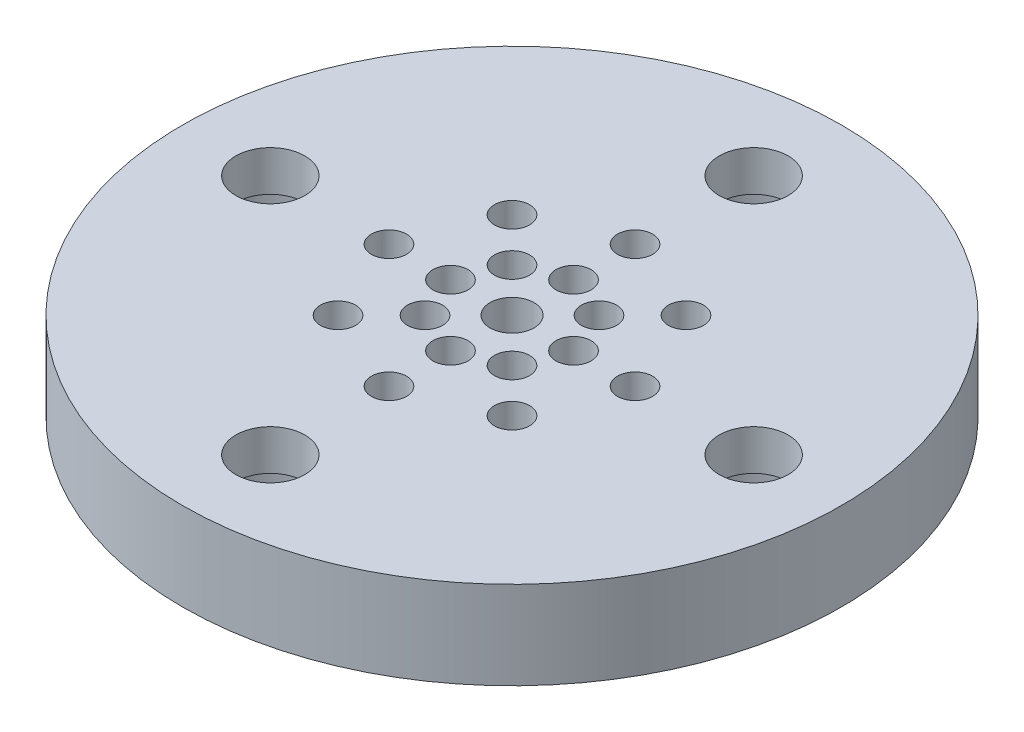
ISO-10303-21;
HEADER;
FILE_DESCRIPTION(('STEP AP214'),'2;1');
FILE_NAME('part.step','',(''),(''),'','','');
FILE_SCHEMA(('AUTOMOTIVE_DESIGN { 1 0 10303 214 1 1 1 1 }'));
ENDSEC;
DATA;
#1=APPLICATION_CONTEXT('core data for automotive mechanical design processes');
#2=APPLICATION_PROTOCOL_DEFINITION('international standard','automotive_design',2000,#1);
#3=PRODUCT_CONTEXT('',#1,'mechanical');
#4=PRODUCT('Part','Part','',(#3));
#5=PRODUCT_RELATED_PRODUCT_CATEGORY('part','',(#4));
#6=PRODUCT_DEFINITION_FORMATION('','',#4);
#7=PRODUCT_DEFINITION_CONTEXT('part definition',#1,'design');
#8=PRODUCT_DEFINITION('design','',#6,#7);
#9=PRODUCT_DEFINITION_SHAPE('','',#8);
#10=(LENGTH_UNIT() NAMED_UNIT(*) SI_UNIT(.MILLI.,.METRE.));
#11=(NAMED_UNIT(*) PLANE_ANGLE_UNIT() SI_UNIT($,.RADIAN.));
#12=(NAMED_UNIT(*) SI_UNIT($,.STERADIAN.) SOLID_ANGLE_UNIT());
#13=UNCERTAINTY_MEASURE_WITH_UNIT(LENGTH_MEASURE(1.E-05),#10,'distance_accuracy_value','');
#14=(GEOMETRIC_REPRESENTATION_CONTEXT(3) GLOBAL_UNCERTAINTY_ASSIGNED_CONTEXT((#13)) GLOBAL_UNIT_ASSIGNED_CONTEXT((#10,
#11,#12)) REPRESENTATION_CONTEXT('',''));
#15=CARTESIAN_POINT('',(0.,0.,0.));
#16=DIRECTION('',(0.,0.,1.));
#17=DIRECTION('',(1.,0.,0.));
#18=AXIS2_PLACEMENT_3D('',#15,#16,#17);
#19=CARTESIAN_POINT('',(0.,30.48,0.));
#20=DIRECTION('',(0.,-1.,0.));
#21=DIRECTION('',(0.,0.,-1.));
#22=AXIS2_PLACEMENT_3D('',#19,#20,#21);
#23=CYLINDRICAL_SURFACE('',#22,23.8125);
#24=CARTESIAN_POINT('',(0.,0.,0.));
#25=DIRECTION('',(0.,-1.,0.));
#26=DIRECTION('',(0.,0.,-1.));
#27=AXIS2_PLACEMENT_3D('',#24,#25,#26);
#28=CIRCLE('',#27,23.8125);
#29=CARTESIAN_POINT('',(0.,0.,-23.8125));
#30=VERTEX_POINT('',#29);
#31=EDGE_CURVE('E47',#30,#30,#28,.T.);
#32=ORIENTED_EDGE('',*,*,#31,.F.);
#33=EDGE_LOOP('',(#32));
#34=FACE_BOUND('',#33,.T.);
#35=CARTESIAN_POINT('',(0.,6.35,0.));
#36=DIRECTION('',(0.,1.,0.));
#37=DIRECTION('',(0.,0.,1.));
#38=AXIS2_PLACEMENT_3D('',#35,#36,#37);
#39=CIRCLE('',#38,23.8125);
#40=CARTESIAN_POINT('',(0.,6.35,23.8125));
#41=VERTEX_POINT('',#40);
#42=EDGE_CURVE('E97',#41,#41,#39,.T.);
#43=ORIENTED_EDGE('',*,*,#42,.F.);
#44=EDGE_LOOP('',(#43));
#45=FACE_BOUND('',#44,.T.);
#46=ADVANCED_FACE('F34',(#34,#45),#23,.T.);
#47=CARTESIAN_POINT('',(0.,0.,0.));
#48=DIRECTION('',(0.,1.,0.));
#49=DIRECTION('',(0.,0.,1.));
#50=AXIS2_PLACEMENT_3D('',#47,#48,#49);
#51=PLANE('',#50);
#52=CARTESIAN_POINT('',(-8.89,0.,0.));
#53=DIRECTION('',(0.,1.,0.));
#54=DIRECTION('',(-1.,0.,0.));
#55=AXIS2_PLACEMENT_3D('',#52,#53,#54);
#56=CIRCLE('',#55,1.27);
#57=CARTESIAN_POINT('',(-10.16,0.,0.));
#58=VERTEX_POINT('',#57);
#59=EDGE_CURVE('E268',#58,#58,#56,.T.);
#60=ORIENTED_EDGE('',*,*,#59,.T.);
#61=EDGE_LOOP('',(#60));
#62=FACE_BOUND('',#61,.T.);
#63=CARTESIAN_POINT('',(-6.28617928474837,0.,-6.28617928474844));
#64=DIRECTION('',(0.,1.,0.));
#65=DIRECTION('',(-0.707106781186544,0.,-0.707106781186551));
#66=AXIS2_PLACEMENT_3D('',#63,#64,#65);
#67=CIRCLE('',#66,1.27);
#68=CARTESIAN_POINT('',(-7.18420489685528,0.,-7.18420489685536));
#69=VERTEX_POINT('',#68);
#70=EDGE_CURVE('E275',#69,#69,#67,.T.);
#71=ORIENTED_EDGE('',*,*,#70,.T.);
#72=EDGE_LOOP('',(#71));
#73=FACE_BOUND('',#72,.T.);
#74=CARTESIAN_POINT('',(0.,0.,-8.89));
#75=DIRECTION('',(0.,1.,0.));
#76=DIRECTION('',(0.,0.,-1.));
#77=AXIS2_PLACEMENT_3D('',#74,#75,#76);
#78=CIRCLE('',#77,1.27);
#79=CARTESIAN_POINT('',(0.,0.,-10.16));
#80=VERTEX_POINT('',#79);
#81=EDGE_CURVE('E281',#80,#80,#78,.T.);
#82=ORIENTED_EDGE('',*,*,#81,.T.);
#83=EDGE_LOOP('',(#82));
#84=FACE_BOUND('',#83,.T.);
#85=CARTESIAN_POINT('',(6.28617928474846,0.,-6.28617928474835));
#86=DIRECTION('',(0.,1.,0.));
#87=DIRECTION('',(0.707106781186554,0.,-0.707106781186541));
#88=AXIS2_PLACEMENT_3D('',#85,#86,#87);
#89=CIRCLE('',#88,1.27);
#90=CARTESIAN_POINT('',(7.18420489685538,0.,-7.18420489685526));
#91=VERTEX_POINT('',#90);
#92=EDGE_CURVE('E287',#91,#91,#89,.T.);
#93=ORIENTED_EDGE('',*,*,#92,.T.);
#94=EDGE_LOOP('',(#93));
#95=FACE_BOUND('',#94,.T.);
#96=CARTESIAN_POINT('',(8.89,0.,0.));
#97=DIRECTION('',(0.,1.,0.));
#98=DIRECTION('',(1.,0.,0.));
#99=AXIS2_PLACEMENT_3D('',#96,#97,#98);
#100=CIRCLE('',#99,1.27);
#101=CARTESIAN_POINT('',(10.16,0.,1.06420351207939E-13));
#102=VERTEX_POINT('',#101);
#103=EDGE_CURVE('E253',#102,#102,#100,.T.);
#104=ORIENTED_EDGE('',*,*,#103,.T.);
#105=EDGE_LOOP('',(#104));
#106=FACE_BOUND('',#105,.T.);
#107=CARTESIAN_POINT('',(6.28617928474833,0.,6.28617928474848));
#108=DIRECTION('',(0.,1.,0.));
#109=DIRECTION('',(0.707106781186539,0.,0.707106781186556));
#110=AXIS2_PLACEMENT_3D('',#107,#108,#109);
#111=CIRCLE('',#110,1.27);
#112=CARTESIAN_POINT('',(7.18420489685523,0.,7.18420489685541));
#113=VERTEX_POINT('',#112);
#114=EDGE_CURVE('E258',#113,#113,#111,.T.);
#115=ORIENTED_EDGE('',*,*,#114,.T.);
#116=EDGE_LOOP('',(#115));
#117=FACE_BOUND('',#116,.T.);
#118=CARTESIAN_POINT('',(-6.28617928474842,0.,6.2861792847484));
#119=DIRECTION('',(0.,1.,0.));
#120=DIRECTION('',(-0.707106781186549,0.,0.707106781186546));
#121=AXIS2_PLACEMENT_3D('',#118,#119,#120);
#122=CIRCLE('',#121,1.27);
#123=CARTESIAN_POINT('',(-7.18420489685534,0.,7.18420489685531));
#124=VERTEX_POINT('',#123);
#125=EDGE_CURVE('E292',#124,#124,#122,.T.);
#126=ORIENTED_EDGE('',*,*,#125,.T.);
#127=EDGE_LOOP('',(#126));
#128=FACE_BOUND('',#127,.T.);
#129=CARTESIAN_POINT('',(0.,0.,8.89));
#130=DIRECTION('',(0.,1.,0.));
#131=DIRECTION('',(0.,0.,1.));
#132=AXIS2_PLACEMENT_3D('',#129,#130,#131);
#133=CIRCLE('',#132,1.27);
#134=CARTESIAN_POINT('',(0.,0.,10.16));
#135=VERTEX_POINT('',#134);
#136=EDGE_CURVE('E298',#135,#135,#133,.T.);
#137=ORIENTED_EDGE('',*,*,#136,.T.);
#138=EDGE_LOOP('',(#137));
#139=FACE_BOUND('',#138,.T.);
#140=CARTESIAN_POINT('',(-4.445,0.,0.));
#141=DIRECTION('',(0.,1.,0.));
#142=DIRECTION('',(-1.,0.,0.));
#143=AXIS2_PLACEMENT_3D('',#140,#141,#142);
#144=CIRCLE('',#143,1.27);
#145=CARTESIAN_POINT('',(-5.715,0.,0.));
#146=VERTEX_POINT('',#145);
#147=EDGE_CURVE('E316',#146,#146,#144,.T.);
#148=ORIENTED_EDGE('',*,*,#147,.T.);
#149=EDGE_LOOP('',(#148));
#150=FACE_BOUND('',#149,.T.);
#151=CARTESIAN_POINT('',(-3.14308964237419,0.,-3.14308964237422));
#152=DIRECTION('',(0.,1.,0.));
#153=DIRECTION('',(-0.707106781186544,0.,-0.707106781186551));
#154=AXIS2_PLACEMENT_3D('',#151,#152,#153);
#155=CIRCLE('',#154,1.27);
#156=CARTESIAN_POINT('',(-4.0411152544811,0.,-4.04111525448114));
#157=VERTEX_POINT('',#156);
#158=EDGE_CURVE('E323',#157,#157,#155,.T.);
#159=ORIENTED_EDGE('',*,*,#158,.T.);
#160=EDGE_LOOP('',(#159));
#161=FACE_BOUND('',#160,.T.);
#162=CARTESIAN_POINT('',(0.,0.,-4.445));
#163=DIRECTION('',(0.,1.,0.));
#164=DIRECTION('',(0.,0.,-1.));
#165=AXIS2_PLACEMENT_3D('',#162,#163,#164);
#166=CIRCLE('',#165,1.27);
#167=CARTESIAN_POINT('',(0.,0.,-5.715));
#168=VERTEX_POINT('',#167);
#169=EDGE_CURVE('E329',#168,#168,#166,.T.);
#170=ORIENTED_EDGE('',*,*,#169,.T.);
#171=EDGE_LOOP('',(#170));
#172=FACE_BOUND('',#171,.T.);
#173=CARTESIAN_POINT('',(3.14308964237423,0.,-3.14308964237418));
#174=DIRECTION('',(0.,1.,0.));
#175=DIRECTION('',(0.707106781186554,0.,-0.707106781186541));
#176=AXIS2_PLACEMENT_3D('',#173,#174,#175);
#177=CIRCLE('',#176,1.27);
#178=CARTESIAN_POINT('',(4.04111525448115,0.,-4.04111525448108));
#179=VERTEX_POINT('',#178);
#180=EDGE_CURVE('E335',#179,#179,#177,.T.);
#181=ORIENTED_EDGE('',*,*,#180,.T.);
#182=EDGE_LOOP('',(#181));
#183=FACE_BOUND('',#182,.T.);
#184=CARTESIAN_POINT('',(4.445,0.,0.));
#185=DIRECTION('',(0.,1.,0.));
#186=DIRECTION('',(1.,0.,0.));
#187=AXIS2_PLACEMENT_3D('',#184,#185,#186);
#188=CIRCLE('',#187,1.27);
#189=CARTESIAN_POINT('',(5.715,0.,0.));
#190=VERTEX_POINT('',#189);
#191=EDGE_CURVE('E304',#190,#190,#188,.T.);
#192=ORIENTED_EDGE('',*,*,#191,.T.);
#193=EDGE_LOOP('',(#192));
#194=FACE_BOUND('',#193,.T.);
#195=CARTESIAN_POINT('',(3.14308964237417,0.,3.14308964237424));
#196=DIRECTION('',(0.,1.,0.));
#197=DIRECTION('',(0.707106781186539,0.,0.707106781186556));
#198=AXIS2_PLACEMENT_3D('',#195,#196,#197);
#199=CIRCLE('',#198,1.27);
#200=CARTESIAN_POINT('',(4.04111525448107,0.,4.04111525448117));
#201=VERTEX_POINT('',#200);
#202=EDGE_CURVE('E311',#201,#201,#199,.T.);
#203=ORIENTED_EDGE('',*,*,#202,.T.);
#204=EDGE_LOOP('',(#203));
#205=FACE_BOUND('',#204,.T.);
#206=CARTESIAN_POINT('',(-3.14308964237421,0.,3.1430896423742));
#207=DIRECTION('',(0.,1.,0.));
#208=DIRECTION('',(-0.707106781186549,0.,0.707106781186546));
#209=AXIS2_PLACEMENT_3D('',#206,#207,#208);
#210=CIRCLE('',#209,1.27);
#211=CARTESIAN_POINT('',(-4.04111525448113,0.,4.04111525448111));
#212=VERTEX_POINT('',#211);
#213=EDGE_CURVE('E340',#212,#212,#210,.T.);
#214=ORIENTED_EDGE('',*,*,#213,.T.);
#215=EDGE_LOOP('',(#214));
#216=FACE_BOUND('',#215,.T.);
#217=CARTESIAN_POINT('',(0.,0.,4.445));
#218=DIRECTION('',(0.,1.,0.));
#219=DIRECTION('',(0.,0.,1.));
#220=AXIS2_PLACEMENT_3D('',#217,#218,#219);
#221=CIRCLE('',#220,1.27);
#222=CARTESIAN_POINT('',(0.,0.,5.715));
#223=VERTEX_POINT('',#222);
#224=EDGE_CURVE('E100',#223,#223,#221,.T.);
#225=ORIENTED_EDGE('',*,*,#224,.T.);
#226=EDGE_LOOP('',(#225));
#227=FACE_BOUND('',#226,.T.);
#228=CARTESIAN_POINT('',(0.,0.,17.4625));
#229=DIRECTION('',(0.,-1.,0.));
#230=DIRECTION('',(0.,0.,-1.));
#231=AXIS2_PLACEMENT_3D('',#228,#229,#230);
#232=CIRCLE('',#231,4.7625);
#233=CARTESIAN_POINT('',(0.,0.,12.7));
#234=VERTEX_POINT('',#233);
#235=EDGE_CURVE('E99',#234,#234,#232,.T.);
#236=ORIENTED_EDGE('',*,*,#235,.F.);
#237=EDGE_LOOP('',(#236));
#238=FACE_BOUND('',#237,.T.);
#239=CARTESIAN_POINT('',(17.4625,0.,0.));
#240=DIRECTION('',(0.,-1.,0.));
#241=DIRECTION('',(0.,0.,-1.));
#242=AXIS2_PLACEMENT_3D('',#239,#240,#241);
#243=CIRCLE('',#242,4.7625);
#244=CARTESIAN_POINT('',(17.4625,0.,-4.7625));
#245=VERTEX_POINT('',#244);
#246=EDGE_CURVE('E74',#245,#245,#243,.T.);
#247=ORIENTED_EDGE('',*,*,#246,.F.);
#248=EDGE_LOOP('',(#247));
#249=FACE_BOUND('',#248,.T.);
#250=CARTESIAN_POINT('',(-17.4625,0.,0.));
#251=DIRECTION('',(0.,-1.,0.));
#252=DIRECTION('',(0.,0.,-1.));
#253=AXIS2_PLACEMENT_3D('',#250,#251,#252);
#254=CIRCLE('',#253,4.7625);
#255=CARTESIAN_POINT('',(-17.4625,0.,-4.7625));
#256=VERTEX_POINT('',#255);
#257=EDGE_CURVE('E61',#256,#256,#254,.T.);
#258=ORIENTED_EDGE('',*,*,#257,.F.);
#259=EDGE_LOOP('',(#258));
#260=FACE_BOUND('',#259,.T.);
#261=CARTESIAN_POINT('',(0.,0.,-17.4625));
#262=DIRECTION('',(0.,-1.,0.));
#263=DIRECTION('',(0.,0.,-1.));
#264=AXIS2_PLACEMENT_3D('',#261,#262,#263);
#265=CIRCLE('',#264,4.7625);
#266=CARTESIAN_POINT('',(0.,0.,-22.225));
#267=VERTEX_POINT('',#266);
#268=EDGE_CURVE('E57',#267,#267,#265,.T.);
#269=ORIENTED_EDGE('',*,*,#268,.F.);
#270=EDGE_LOOP('',(#269));
#271=FACE_BOUND('',#270,.T.);
#272=CARTESIAN_POINT('',(0.,0.,0.));
#273=DIRECTION('',(0.,1.,0.));
#274=DIRECTION('',(0.,0.,1.));
#275=AXIS2_PLACEMENT_3D('',#272,#273,#274);
#276=CIRCLE('',#275,1.5875);
#277=CARTESIAN_POINT('',(0.,0.,1.5875));
#278=VERTEX_POINT('',#277);
#279=EDGE_CURVE('E11',#278,#278,#276,.F.);
#280=ORIENTED_EDGE('',*,*,#279,.F.);
#281=EDGE_LOOP('',(#280));
#282=FACE_BOUND('',#281,.T.);
#283=ORIENTED_EDGE('',*,*,#31,.T.);
#284=EDGE_LOOP('',(#283));
#285=FACE_BOUND('',#284,.T.);
#286=ADVANCED_FACE('F36',(#62,#73,#84,#95,#106,#117,#128,#139,#150,#161,#172,#183,#194,#205,
#216,#227,#238,#249,#260,#271,#282,#285),#51,.F.);
#287=CARTESIAN_POINT('',(0.,6.35,0.));
#288=DIRECTION('',(0.,1.,0.));
#289=DIRECTION('',(0.,0.,1.));
#290=AXIS2_PLACEMENT_3D('',#287,#288,#289);
#291=PLANE('',#290);
#292=CARTESIAN_POINT('',(-8.89,6.35,0.));
#293=DIRECTION('',(0.,1.,0.));
#294=DIRECTION('',(-1.,0.,0.));
#295=AXIS2_PLACEMENT_3D('',#292,#293,#294);
#296=CIRCLE('',#295,1.27);
#297=CARTESIAN_POINT('',(-10.16,6.35,0.));
#298=VERTEX_POINT('',#297);
#299=EDGE_CURVE('E272',#298,#298,#296,.T.);
#300=ORIENTED_EDGE('',*,*,#299,.F.);
#301=EDGE_LOOP('',(#300));
#302=FACE_BOUND('',#301,.T.);
#303=CARTESIAN_POINT('',(-6.28617928474837,6.35,-6.28617928474844));
#304=DIRECTION('',(0.,1.,0.));
#305=DIRECTION('',(-0.707106781186544,0.,-0.707106781186551));
#306=AXIS2_PLACEMENT_3D('',#303,#304,#305);
#307=CIRCLE('',#306,1.27);
#308=CARTESIAN_POINT('',(-7.18420489685528,6.35,-7.18420489685536));
#309=VERTEX_POINT('',#308);
#310=EDGE_CURVE('E278',#309,#309,#307,.T.);
#311=ORIENTED_EDGE('',*,*,#310,.F.);
#312=EDGE_LOOP('',(#311));
#313=FACE_BOUND('',#312,.T.);
#314=CARTESIAN_POINT('',(0.,6.35,-8.89));
#315=DIRECTION('',(0.,1.,0.));
#316=DIRECTION('',(0.,0.,-1.));
#317=AXIS2_PLACEMENT_3D('',#314,#315,#316);
#318=CIRCLE('',#317,1.27);
#319=CARTESIAN_POINT('',(0.,6.35,-10.16));
#320=VERTEX_POINT('',#319);
#321=EDGE_CURVE('E284',#320,#320,#318,.T.);
#322=ORIENTED_EDGE('',*,*,#321,.F.);
#323=EDGE_LOOP('',(#322));
#324=FACE_BOUND('',#323,.T.);
#325=CARTESIAN_POINT('',(6.28617928474846,6.35,-6.28617928474835));
#326=DIRECTION('',(0.,1.,0.));
#327=DIRECTION('',(0.707106781186554,0.,-0.707106781186541));
#328=AXIS2_PLACEMENT_3D('',#325,#326,#327);
#329=CIRCLE('',#328,1.27);
#330=CARTESIAN_POINT('',(7.18420489685538,6.35,-7.18420489685526));
#331=VERTEX_POINT('',#330);
#332=EDGE_CURVE('E260',#331,#331,#329,.T.);
#333=ORIENTED_EDGE('',*,*,#332,.F.);
#334=EDGE_LOOP('',(#333));
#335=FACE_BOUND('',#334,.T.);
#336=CARTESIAN_POINT('',(8.89,6.35,0.));
#337=DIRECTION('',(0.,1.,0.));
#338=DIRECTION('',(1.,0.,0.));
#339=AXIS2_PLACEMENT_3D('',#336,#337,#338);
#340=CIRCLE('',#339,1.27);
#341=CARTESIAN_POINT('',(10.16,6.35,1.06420351207939E-13));
#342=VERTEX_POINT('',#341);
#343=EDGE_CURVE('E256',#342,#342,#340,.T.);
#344=ORIENTED_EDGE('',*,*,#343,.F.);
#345=EDGE_LOOP('',(#344));
#346=FACE_BOUND('',#345,.T.);
#347=CARTESIAN_POINT('',(6.28617928474833,6.35,6.28617928474848));
#348=DIRECTION('',(0.,1.,0.));
#349=DIRECTION('',(0.707106781186539,0.,0.707106781186556));
#350=AXIS2_PLACEMENT_3D('',#347,#348,#349);
#351=CIRCLE('',#350,1.27);
#352=CARTESIAN_POINT('',(7.18420489685523,6.35,7.18420489685541));
#353=VERTEX_POINT('',#352);
#354=EDGE_CURVE('E263',#353,#353,#351,.T.);
#355=ORIENTED_EDGE('',*,*,#354,.F.);
#356=EDGE_LOOP('',(#355));
#357=FACE_BOUND('',#356,.T.);
#358=CARTESIAN_POINT('',(-6.28617928474842,6.35,6.2861792847484));
#359=DIRECTION('',(0.,1.,0.));
#360=DIRECTION('',(-0.707106781186549,0.,0.707106781186546));
#361=AXIS2_PLACEMENT_3D('',#358,#359,#360);
#362=CIRCLE('',#361,1.27);
#363=CARTESIAN_POINT('',(-7.18420489685534,6.35,7.18420489685531));
#364=VERTEX_POINT('',#363);
#365=EDGE_CURVE('E271',#364,#364,#362,.T.);
#366=ORIENTED_EDGE('',*,*,#365,.F.);
#367=EDGE_LOOP('',(#366));
#368=FACE_BOUND('',#367,.T.);
#369=CARTESIAN_POINT('',(0.,6.35,8.89));
#370=DIRECTION('',(0.,1.,0.));
#371=DIRECTION('',(0.,0.,1.));
#372=AXIS2_PLACEMENT_3D('',#369,#370,#371);
#373=CIRCLE('',#372,1.27);
#374=CARTESIAN_POINT('',(0.,6.35,10.16));
#375=VERTEX_POINT('',#374);
#376=EDGE_CURVE('E295',#375,#375,#373,.T.);
#377=ORIENTED_EDGE('',*,*,#376,.F.);
#378=EDGE_LOOP('',(#377));
#379=FACE_BOUND('',#378,.T.);
#380=CARTESIAN_POINT('',(-4.445,6.35,0.));
#381=DIRECTION('',(0.,1.,0.));
#382=DIRECTION('',(-1.,0.,0.));
#383=AXIS2_PLACEMENT_3D('',#380,#381,#382);
#384=CIRCLE('',#383,1.27);
#385=CARTESIAN_POINT('',(-5.715,6.35,0.));
#386=VERTEX_POINT('',#385);
#387=EDGE_CURVE('E320',#386,#386,#384,.T.);
#388=ORIENTED_EDGE('',*,*,#387,.F.);
#389=EDGE_LOOP('',(#388));
#390=FACE_BOUND('',#389,.T.);
#391=CARTESIAN_POINT('',(-3.14308964237419,6.35,-3.14308964237422));
#392=DIRECTION('',(0.,1.,0.));
#393=DIRECTION('',(-0.707106781186544,0.,-0.707106781186551));
#394=AXIS2_PLACEMENT_3D('',#391,#392,#393);
#395=CIRCLE('',#394,1.27);
#396=CARTESIAN_POINT('',(-4.0411152544811,6.35,-4.04111525448114));
#397=VERTEX_POINT('',#396);
#398=EDGE_CURVE('E326',#397,#397,#395,.T.);
#399=ORIENTED_EDGE('',*,*,#398,.F.);
#400=EDGE_LOOP('',(#399));
#401=FACE_BOUND('',#400,.T.);
#402=CARTESIAN_POINT('',(0.,6.35,-4.445));
#403=DIRECTION('',(0.,1.,0.));
#404=DIRECTION('',(0.,0.,-1.));
#405=AXIS2_PLACEMENT_3D('',#402,#403,#404);
#406=CIRCLE('',#405,1.27);
#407=CARTESIAN_POINT('',(0.,6.35,-5.715));
#408=VERTEX_POINT('',#407);
#409=EDGE_CURVE('E332',#408,#408,#406,.T.);
#410=ORIENTED_EDGE('',*,*,#409,.F.);
#411=EDGE_LOOP('',(#410));
#412=FACE_BOUND('',#411,.T.);
#413=CARTESIAN_POINT('',(3.14308964237423,6.35,-3.14308964237418));
#414=DIRECTION('',(0.,1.,0.));
#415=DIRECTION('',(0.707106781186554,0.,-0.707106781186541));
#416=AXIS2_PLACEMENT_3D('',#413,#414,#415);
#417=CIRCLE('',#416,1.27);
#418=CARTESIAN_POINT('',(4.04111525448115,6.35,-4.04111525448108));
#419=VERTEX_POINT('',#418);
#420=EDGE_CURVE('E307',#419,#419,#417,.T.);
#421=ORIENTED_EDGE('',*,*,#420,.F.);
#422=EDGE_LOOP('',(#421));
#423=FACE_BOUND('',#422,.T.);
#424=CARTESIAN_POINT('',(4.445,6.35,0.));
#425=DIRECTION('',(0.,1.,0.));
#426=DIRECTION('',(1.,0.,0.));
#427=AXIS2_PLACEMENT_3D('',#424,#425,#426);
#428=CIRCLE('',#427,1.27);
#429=CARTESIAN_POINT('',(5.715,6.35,0.));
#430=VERTEX_POINT('',#429);
#431=EDGE_CURVE('E308',#430,#430,#428,.T.);
#432=ORIENTED_EDGE('',*,*,#431,.F.);
#433=EDGE_LOOP('',(#432));
#434=FACE_BOUND('',#433,.T.);
#435=CARTESIAN_POINT('',(3.14308964237417,6.35,3.14308964237424));
#436=DIRECTION('',(0.,1.,0.));
#437=DIRECTION('',(0.707106781186539,0.,0.707106781186556));
#438=AXIS2_PLACEMENT_3D('',#435,#436,#437);
#439=CIRCLE('',#438,1.27);
#440=CARTESIAN_POINT('',(4.04111525448107,6.35,4.04111525448117));
#441=VERTEX_POINT('',#440);
#442=EDGE_CURVE('E301',#441,#441,#439,.T.);
#443=ORIENTED_EDGE('',*,*,#442,.F.);
#444=EDGE_LOOP('',(#443));
#445=FACE_BOUND('',#444,.T.);
#446=CARTESIAN_POINT('',(-3.14308964237421,6.35,3.1430896423742));
#447=DIRECTION('',(0.,1.,0.));
#448=DIRECTION('',(-0.707106781186549,0.,0.707106781186546));
#449=AXIS2_PLACEMENT_3D('',#446,#447,#448);
#450=CIRCLE('',#449,1.27);
#451=CARTESIAN_POINT('',(-4.04111525448113,6.35,4.04111525448111));
#452=VERTEX_POINT('',#451);
#453=EDGE_CURVE('E319',#452,#452,#450,.T.);
#454=ORIENTED_EDGE('',*,*,#453,.F.);
#455=EDGE_LOOP('',(#454));
#456=FACE_BOUND('',#455,.T.);
#457=CARTESIAN_POINT('',(0.,6.35,4.445));
#458=DIRECTION('',(0.,1.,0.));
#459=DIRECTION('',(0.,0.,1.));
#460=AXIS2_PLACEMENT_3D('',#457,#458,#459);
#461=CIRCLE('',#460,1.27);
#462=CARTESIAN_POINT('',(0.,6.35,5.715));
#463=VERTEX_POINT('',#462);
#464=EDGE_CURVE('E106',#463,#463,#461,.T.);
#465=ORIENTED_EDGE('',*,*,#464,.F.);
#466=EDGE_LOOP('',(#465));
#467=FACE_BOUND('',#466,.T.);
#468=CARTESIAN_POINT('',(0.,6.35,17.4625));
#469=DIRECTION('',(0.,1.,0.));
#470=DIRECTION('',(0.,0.,1.));
#471=AXIS2_PLACEMENT_3D('',#468,#469,#470);
#472=CIRCLE('',#471,2.4892);
#473=CARTESIAN_POINT('',(0.,6.35,19.9517));
#474=VERTEX_POINT('',#473);
#475=EDGE_CURVE('E38',#474,#474,#472,.T.);
#476=ORIENTED_EDGE('',*,*,#475,.F.);
#477=EDGE_LOOP('',(#476));
#478=FACE_BOUND('',#477,.T.);
#479=CARTESIAN_POINT('',(17.4625,6.35,0.));
#480=DIRECTION('',(0.,1.,0.));
#481=DIRECTION('',(0.,0.,1.));
#482=AXIS2_PLACEMENT_3D('',#479,#480,#481);
#483=CIRCLE('',#482,2.4892);
#484=CARTESIAN_POINT('',(17.4625,6.35,2.4892));
#485=VERTEX_POINT('',#484);
#486=EDGE_CURVE('E59',#485,#485,#483,.T.);
#487=ORIENTED_EDGE('',*,*,#486,.F.);
#488=EDGE_LOOP('',(#487));
#489=FACE_BOUND('',#488,.T.);
#490=CARTESIAN_POINT('',(-17.4625,6.35,0.));
#491=DIRECTION('',(0.,1.,0.));
#492=DIRECTION('',(0.,0.,1.));
#493=AXIS2_PLACEMENT_3D('',#490,#491,#492);
#494=CIRCLE('',#493,2.4892);
#495=CARTESIAN_POINT('',(-17.4625,6.35,2.4892));
#496=VERTEX_POINT('',#495);
#497=EDGE_CURVE('E55',#496,#496,#494,.T.);
#498=ORIENTED_EDGE('',*,*,#497,.F.);
#499=EDGE_LOOP('',(#498));
#500=FACE_BOUND('',#499,.T.);
#501=CARTESIAN_POINT('',(0.,6.35,-17.4625));
#502=DIRECTION('',(0.,1.,0.));
#503=DIRECTION('',(0.,0.,1.));
#504=AXIS2_PLACEMENT_3D('',#501,#502,#503);
#505=CIRCLE('',#504,2.4892);
#506=CARTESIAN_POINT('',(0.,6.35,-14.9733));
#507=VERTEX_POINT('',#506);
#508=EDGE_CURVE('E51',#507,#507,#505,.T.);
#509=ORIENTED_EDGE('',*,*,#508,.F.);
#510=EDGE_LOOP('',(#509));
#511=FACE_BOUND('',#510,.T.);
#512=CARTESIAN_POINT('',(0.,6.35,0.));
#513=DIRECTION('',(0.,1.,0.));
#514=DIRECTION('',(0.,0.,1.));
#515=AXIS2_PLACEMENT_3D('',#512,#513,#514);
#516=CIRCLE('',#515,1.5875);
#517=CARTESIAN_POINT('',(0.,6.35,1.5875));
#518=VERTEX_POINT('',#517);
#519=EDGE_CURVE('E42',#518,#518,#516,.T.);
#520=ORIENTED_EDGE('',*,*,#519,.F.);
#521=EDGE_LOOP('',(#520));
#522=FACE_BOUND('',#521,.T.);
#523=ORIENTED_EDGE('',*,*,#42,.T.);
#524=EDGE_LOOP('',(#523));
#525=FACE_BOUND('',#524,.T.);
#526=ADVANCED_FACE('F123',(#302,#313,#324,#335,#346,#357,#368,#379,#390,#401,#412,#423,#434,
#445,#456,#467,#478,#489,#500,#511,#522,#525),#291,.T.);
#527=CARTESIAN_POINT('',(0.,-0.00100000000000013,0.));
#528=DIRECTION('',(0.,1.,0.));
#529=DIRECTION('',(0.,0.,1.));
#530=AXIS2_PLACEMENT_3D('',#527,#528,#529);
#531=CYLINDRICAL_SURFACE('',#530,1.5875);
#532=ORIENTED_EDGE('',*,*,#519,.T.);
#533=EDGE_LOOP('',(#532));
#534=FACE_BOUND('',#533,.T.);
#535=ORIENTED_EDGE('',*,*,#279,.T.);
#536=EDGE_LOOP('',(#535));
#537=FACE_BOUND('',#536,.T.);
#538=ADVANCED_FACE('F126',(#534,#537),#531,.F.);
#539=CARTESIAN_POINT('',(0.,0.,-17.4625));
#540=DIRECTION('',(0.,-1.,0.));
#541=DIRECTION('',(0.,0.,-1.));
#542=AXIS2_PLACEMENT_3D('',#539,#540,#541);
#543=CYLINDRICAL_SURFACE('',#542,2.4892);
#544=ORIENTED_EDGE('',*,*,#508,.T.);
#545=EDGE_LOOP('',(#544));
#546=FACE_BOUND('',#545,.T.);
#547=CARTESIAN_POINT('',(0.,3.429,-17.4625));
#548=DIRECTION('',(0.,-1.,0.));
#549=DIRECTION('',(0.,0.,-1.));
#550=AXIS2_PLACEMENT_3D('',#547,#548,#549);
#551=CIRCLE('',#550,2.4892);
#552=CARTESIAN_POINT('',(0.,3.429,-19.9517));
#553=VERTEX_POINT('',#552);
#554=EDGE_CURVE('E54',#553,#553,#551,.T.);
#555=ORIENTED_EDGE('',*,*,#554,.T.);
#556=EDGE_LOOP('',(#555));
#557=FACE_BOUND('',#556,.T.);
#558=ADVANCED_FACE('F136',(#546,#557),#543,.F.);
#559=CARTESIAN_POINT('',(2.4892,3.429,-17.4625));
#560=DIRECTION('',(0.,1.,0.));
#561=DIRECTION('',(0.,0.,1.));
#562=AXIS2_PLACEMENT_3D('',#559,#560,#561);
#563=PLANE('',#562);
#564=ORIENTED_EDGE('',*,*,#554,.F.);
#565=EDGE_LOOP('',(#564));
#566=FACE_BOUND('',#565,.T.);
#567=CARTESIAN_POINT('',(0.,3.429,-17.4625));
#568=DIRECTION('',(0.,-1.,0.));
#569=DIRECTION('',(0.,0.,-1.));
#570=AXIS2_PLACEMENT_3D('',#567,#568,#569);
#571=CIRCLE('',#570,4.7625);
#572=CARTESIAN_POINT('',(0.,3.429,-22.225));
#573=VERTEX_POINT('',#572);
#574=EDGE_CURVE('E84',#573,#573,#571,.T.);
#575=ORIENTED_EDGE('',*,*,#574,.T.);
#576=EDGE_LOOP('',(#575));
#577=FACE_BOUND('',#576,.T.);
#578=ADVANCED_FACE('F141',(#566,#577),#563,.F.);
#579=CARTESIAN_POINT('',(0.,0.,-17.4625));
#580=DIRECTION('',(0.,-1.,0.));
#581=DIRECTION('',(0.,0.,-1.));
#582=AXIS2_PLACEMENT_3D('',#579,#580,#581);
#583=CYLINDRICAL_SURFACE('',#582,4.7625);
#584=ORIENTED_EDGE('',*,*,#574,.F.);
#585=EDGE_LOOP('',(#584));
#586=FACE_BOUND('',#585,.T.);
#587=ORIENTED_EDGE('',*,*,#268,.T.);
#588=EDGE_LOOP('',(#587));
#589=FACE_BOUND('',#588,.T.);
#590=ADVANCED_FACE('F147',(#586,#589),#583,.F.);
#591=CARTESIAN_POINT('',(-17.4625,0.,0.));
#592=DIRECTION('',(0.,-1.,0.));
#593=DIRECTION('',(0.,0.,-1.));
#594=AXIS2_PLACEMENT_3D('',#591,#592,#593);
#595=CYLINDRICAL_SURFACE('',#594,2.4892);
#596=ORIENTED_EDGE('',*,*,#497,.T.);
#597=EDGE_LOOP('',(#596));
#598=FACE_BOUND('',#597,.T.);
#599=CARTESIAN_POINT('',(-17.4625,3.429,0.));
#600=DIRECTION('',(0.,-1.,0.));
#601=DIRECTION('',(0.,0.,-1.));
#602=AXIS2_PLACEMENT_3D('',#599,#600,#601);
#603=CIRCLE('',#602,2.4892);
#604=CARTESIAN_POINT('',(-17.4625,3.429,-2.4892));
#605=VERTEX_POINT('',#604);
#606=EDGE_CURVE('E58',#605,#605,#603,.T.);
#607=ORIENTED_EDGE('',*,*,#606,.T.);
#608=EDGE_LOOP('',(#607));
#609=FACE_BOUND('',#608,.T.);
#610=ADVANCED_FACE('F151',(#598,#609),#595,.F.);
#611=CARTESIAN_POINT('',(-14.9733,3.429,0.));
#612=DIRECTION('',(0.,1.,0.));
#613=DIRECTION('',(0.,0.,1.));
#614=AXIS2_PLACEMENT_3D('',#611,#612,#613);
#615=PLANE('',#614);
#616=ORIENTED_EDGE('',*,*,#606,.F.);
#617=EDGE_LOOP('',(#616));
#618=FACE_BOUND('',#617,.T.);
#619=CARTESIAN_POINT('',(-17.4625,3.429,0.));
#620=DIRECTION('',(0.,-1.,0.));
#621=DIRECTION('',(0.,0.,-1.));
#622=AXIS2_PLACEMENT_3D('',#619,#620,#621);
#623=CIRCLE('',#622,4.7625);
#624=CARTESIAN_POINT('',(-17.4625,3.429,-4.7625));
#625=VERTEX_POINT('',#624);
#626=EDGE_CURVE('E66',#625,#625,#623,.T.);
#627=ORIENTED_EDGE('',*,*,#626,.T.);
#628=EDGE_LOOP('',(#627));
#629=FACE_BOUND('',#628,.T.);
#630=ADVANCED_FACE('F155',(#618,#629),#615,.F.);
#631=CARTESIAN_POINT('',(-17.4625,0.,0.));
#632=DIRECTION('',(0.,-1.,0.));
#633=DIRECTION('',(0.,0.,-1.));
#634=AXIS2_PLACEMENT_3D('',#631,#632,#633);
#635=CYLINDRICAL_SURFACE('',#634,4.7625);
#636=ORIENTED_EDGE('',*,*,#626,.F.);
#637=EDGE_LOOP('',(#636));
#638=FACE_BOUND('',#637,.T.);
#639=ORIENTED_EDGE('',*,*,#257,.T.);
#640=EDGE_LOOP('',(#639));
#641=FACE_BOUND('',#640,.T.);
#642=ADVANCED_FACE('F159',(#638,#641),#635,.F.);
#643=CARTESIAN_POINT('',(17.4625,0.,0.));
#644=DIRECTION('',(0.,-1.,0.));
#645=DIRECTION('',(0.,0.,-1.));
#646=AXIS2_PLACEMENT_3D('',#643,#644,#645);
#647=CYLINDRICAL_SURFACE('',#646,2.4892);
#648=ORIENTED_EDGE('',*,*,#486,.T.);
#649=EDGE_LOOP('',(#648));
#650=FACE_BOUND('',#649,.T.);
#651=CARTESIAN_POINT('',(17.4625,3.429,0.));
#652=DIRECTION('',(0.,-1.,0.));
#653=DIRECTION('',(0.,0.,-1.));
#654=AXIS2_PLACEMENT_3D('',#651,#652,#653);
#655=CIRCLE('',#654,2.4892);
#656=CARTESIAN_POINT('',(17.4625,3.429,-2.4892));
#657=VERTEX_POINT('',#656);
#658=EDGE_CURVE('E62',#657,#657,#655,.T.);
#659=ORIENTED_EDGE('',*,*,#658,.T.);
#660=EDGE_LOOP('',(#659));
#661=FACE_BOUND('',#660,.T.);
#662=ADVANCED_FACE('F163',(#650,#661),#647,.F.);
#663=CARTESIAN_POINT('',(19.9517,3.429,0.));
#664=DIRECTION('',(0.,1.,0.));
#665=DIRECTION('',(0.,0.,1.));
#666=AXIS2_PLACEMENT_3D('',#663,#664,#665);
#667=PLANE('',#666);
#668=ORIENTED_EDGE('',*,*,#658,.F.);
#669=EDGE_LOOP('',(#668));
#670=FACE_BOUND('',#669,.T.);
#671=CARTESIAN_POINT('',(17.4625,3.429,0.));
#672=DIRECTION('',(0.,-1.,0.));
#673=DIRECTION('',(0.,0.,-1.));
#674=AXIS2_PLACEMENT_3D('',#671,#672,#673);
#675=CIRCLE('',#674,4.7625);
#676=CARTESIAN_POINT('',(17.4625,3.429,-4.7625));
#677=VERTEX_POINT('',#676);
#678=EDGE_CURVE('E69',#677,#677,#675,.T.);
#679=ORIENTED_EDGE('',*,*,#678,.T.);
#680=EDGE_LOOP('',(#679));
#681=FACE_BOUND('',#680,.T.);
#682=ADVANCED_FACE('F167',(#670,#681),#667,.F.);
#683=CARTESIAN_POINT('',(17.4625,0.,0.));
#684=DIRECTION('',(0.,-1.,0.));
#685=DIRECTION('',(0.,0.,-1.));
#686=AXIS2_PLACEMENT_3D('',#683,#684,#685);
#687=CYLINDRICAL_SURFACE('',#686,4.7625);
#688=ORIENTED_EDGE('',*,*,#678,.F.);
#689=EDGE_LOOP('',(#688));
#690=FACE_BOUND('',#689,.T.);
#691=ORIENTED_EDGE('',*,*,#246,.T.);
#692=EDGE_LOOP('',(#691));
#693=FACE_BOUND('',#692,.T.);
#694=ADVANCED_FACE('F170',(#690,#693),#687,.F.);
#695=CARTESIAN_POINT('',(0.,0.,17.4625));
#696=DIRECTION('',(0.,-1.,0.));
#697=DIRECTION('',(0.,0.,-1.));
#698=AXIS2_PLACEMENT_3D('',#695,#696,#697);
#699=CYLINDRICAL_SURFACE('',#698,2.4892);
#700=ORIENTED_EDGE('',*,*,#475,.T.);
#701=EDGE_LOOP('',(#700));
#702=FACE_BOUND('',#701,.T.);
#703=CARTESIAN_POINT('',(0.,3.429,17.4625));
#704=DIRECTION('',(0.,-1.,0.));
#705=DIRECTION('',(0.,0.,-1.));
#706=AXIS2_PLACEMENT_3D('',#703,#704,#705);
#707=CIRCLE('',#706,2.4892);
#708=CARTESIAN_POINT('',(0.,3.429,14.9733));
#709=VERTEX_POINT('',#708);
#710=EDGE_CURVE('E112',#709,#709,#707,.T.);
#711=ORIENTED_EDGE('',*,*,#710,.T.);
#712=EDGE_LOOP('',(#711));
#713=FACE_BOUND('',#712,.T.);
#714=ADVANCED_FACE('F120',(#702,#713),#699,.F.);
#715=CARTESIAN_POINT('',(2.4892,3.429,17.4625));
#716=DIRECTION('',(0.,1.,0.));
#717=DIRECTION('',(0.,0.,1.));
#718=AXIS2_PLACEMENT_3D('',#715,#716,#717);
#719=PLANE('',#718);
#720=ORIENTED_EDGE('',*,*,#710,.F.);
#721=EDGE_LOOP('',(#720));
#722=FACE_BOUND('',#721,.T.);
#723=CARTESIAN_POINT('',(0.,3.429,17.4625));
#724=DIRECTION('',(0.,-1.,0.));
#725=DIRECTION('',(0.,0.,-1.));
#726=AXIS2_PLACEMENT_3D('',#723,#724,#725);
#727=CIRCLE('',#726,4.7625);
#728=CARTESIAN_POINT('',(0.,3.429,12.7));
#729=VERTEX_POINT('',#728);
#730=EDGE_CURVE('E103',#729,#729,#727,.T.);
#731=ORIENTED_EDGE('',*,*,#730,.T.);
#732=EDGE_LOOP('',(#731));
#733=FACE_BOUND('',#732,.T.);
#734=ADVANCED_FACE('F177',(#722,#733),#719,.F.);
#735=CARTESIAN_POINT('',(0.,0.,17.4625));
#736=DIRECTION('',(0.,-1.,0.));
#737=DIRECTION('',(0.,0.,-1.));
#738=AXIS2_PLACEMENT_3D('',#735,#736,#737);
#739=CYLINDRICAL_SURFACE('',#738,4.7625);
#740=ORIENTED_EDGE('',*,*,#730,.F.);
#741=EDGE_LOOP('',(#740));
#742=FACE_BOUND('',#741,.T.);
#743=ORIENTED_EDGE('',*,*,#235,.T.);
#744=EDGE_LOOP('',(#743));
#745=FACE_BOUND('',#744,.T.);
#746=ADVANCED_FACE('F180',(#742,#745),#739,.F.);
#747=CARTESIAN_POINT('',(0.,0.,4.445));
#748=DIRECTION('',(0.,1.,0.));
#749=DIRECTION('',(0.,0.,1.));
#750=AXIS2_PLACEMENT_3D('',#747,#748,#749);
#751=CYLINDRICAL_SURFACE('',#750,1.27);
#752=ORIENTED_EDGE('',*,*,#224,.F.);
#753=EDGE_LOOP('',(#752));
#754=FACE_BOUND('',#753,.T.);
#755=ORIENTED_EDGE('',*,*,#464,.T.);
#756=EDGE_LOOP('',(#755));
#757=FACE_BOUND('',#756,.T.);
#758=ADVANCED_FACE('F184',(#754,#757),#751,.F.);
#759=CARTESIAN_POINT('',(-3.14308964237421,0.,3.1430896423742));
#760=DIRECTION('',(0.,1.,0.));
#761=DIRECTION('',(0.,0.,1.));
#762=AXIS2_PLACEMENT_3D('',#759,#760,#761);
#763=CYLINDRICAL_SURFACE('',#762,1.27);
#764=ORIENTED_EDGE('',*,*,#213,.F.);
#765=EDGE_LOOP('',(#764));
#766=FACE_BOUND('',#765,.T.);
#767=ORIENTED_EDGE('',*,*,#453,.T.);
#768=EDGE_LOOP('',(#767));
#769=FACE_BOUND('',#768,.T.);
#770=ADVANCED_FACE('F188',(#766,#769),#763,.F.);
#771=CARTESIAN_POINT('',(3.14308964237417,0.,3.14308964237424));
#772=DIRECTION('',(0.,1.,0.));
#773=DIRECTION('',(0.,0.,1.));
#774=AXIS2_PLACEMENT_3D('',#771,#772,#773);
#775=CYLINDRICAL_SURFACE('',#774,1.27);
#776=ORIENTED_EDGE('',*,*,#202,.F.);
#777=EDGE_LOOP('',(#776));
#778=FACE_BOUND('',#777,.T.);
#779=ORIENTED_EDGE('',*,*,#442,.T.);
#780=EDGE_LOOP('',(#779));
#781=FACE_BOUND('',#780,.T.);
#782=ADVANCED_FACE('F192',(#778,#781),#775,.F.);
#783=CARTESIAN_POINT('',(4.445,0.,0.));
#784=DIRECTION('',(0.,1.,0.));
#785=DIRECTION('',(0.,0.,1.));
#786=AXIS2_PLACEMENT_3D('',#783,#784,#785);
#787=CYLINDRICAL_SURFACE('',#786,1.27);
#788=ORIENTED_EDGE('',*,*,#191,.F.);
#789=EDGE_LOOP('',(#788));
#790=FACE_BOUND('',#789,.T.);
#791=ORIENTED_EDGE('',*,*,#431,.T.);
#792=EDGE_LOOP('',(#791));
#793=FACE_BOUND('',#792,.T.);
#794=ADVANCED_FACE('F198',(#790,#793),#787,.F.);
#795=CARTESIAN_POINT('',(3.14308964237423,0.,-3.14308964237418));
#796=DIRECTION('',(0.,1.,0.));
#797=DIRECTION('',(0.,0.,1.));
#798=AXIS2_PLACEMENT_3D('',#795,#796,#797);
#799=CYLINDRICAL_SURFACE('',#798,1.27);
#800=ORIENTED_EDGE('',*,*,#180,.F.);
#801=EDGE_LOOP('',(#800));
#802=FACE_BOUND('',#801,.T.);
#803=ORIENTED_EDGE('',*,*,#420,.T.);
#804=EDGE_LOOP('',(#803));
#805=FACE_BOUND('',#804,.T.);
#806=ADVANCED_FACE('F194',(#802,#805),#799,.F.);
#807=CARTESIAN_POINT('',(0.,0.,-4.445));
#808=DIRECTION('',(0.,1.,0.));
#809=DIRECTION('',(0.,0.,1.));
#810=AXIS2_PLACEMENT_3D('',#807,#808,#809);
#811=CYLINDRICAL_SURFACE('',#810,1.27);
#812=ORIENTED_EDGE('',*,*,#169,.F.);
#813=EDGE_LOOP('',(#812));
#814=FACE_BOUND('',#813,.T.);
#815=ORIENTED_EDGE('',*,*,#409,.T.);
#816=EDGE_LOOP('',(#815));
#817=FACE_BOUND('',#816,.T.);
#818=ADVANCED_FACE('F197',(#814,#817),#811,.F.);
#819=CARTESIAN_POINT('',(-3.14308964237419,0.,-3.14308964237422));
#820=DIRECTION('',(0.,1.,0.));
#821=DIRECTION('',(0.,0.,1.));
#822=AXIS2_PLACEMENT_3D('',#819,#820,#821);
#823=CYLINDRICAL_SURFACE('',#822,1.27);
#824=ORIENTED_EDGE('',*,*,#158,.F.);
#825=EDGE_LOOP('',(#824));
#826=FACE_BOUND('',#825,.T.);
#827=ORIENTED_EDGE('',*,*,#398,.T.);
#828=EDGE_LOOP('',(#827));
#829=FACE_BOUND('',#828,.T.);
#830=ADVANCED_FACE('F202',(#826,#829),#823,.F.);
#831=CARTESIAN_POINT('',(-4.445,0.,0.));
#832=DIRECTION('',(0.,1.,0.));
#833=DIRECTION('',(0.,0.,1.));
#834=AXIS2_PLACEMENT_3D('',#831,#832,#833);
#835=CYLINDRICAL_SURFACE('',#834,1.27);
#836=ORIENTED_EDGE('',*,*,#147,.F.);
#837=EDGE_LOOP('',(#836));
#838=FACE_BOUND('',#837,.T.);
#839=ORIENTED_EDGE('',*,*,#387,.T.);
#840=EDGE_LOOP('',(#839));
#841=FACE_BOUND('',#840,.T.);
#842=ADVANCED_FACE('F206',(#838,#841),#835,.F.);
#843=CARTESIAN_POINT('',(0.,0.,8.89));
#844=DIRECTION('',(0.,1.,0.));
#845=DIRECTION('',(0.,0.,1.));
#846=AXIS2_PLACEMENT_3D('',#843,#844,#845);
#847=CYLINDRICAL_SURFACE('',#846,1.27);
#848=ORIENTED_EDGE('',*,*,#136,.F.);
#849=EDGE_LOOP('',(#848));
#850=FACE_BOUND('',#849,.T.);
#851=ORIENTED_EDGE('',*,*,#376,.T.);
#852=EDGE_LOOP('',(#851));
#853=FACE_BOUND('',#852,.T.);
#854=ADVANCED_FACE('F210',(#850,#853),#847,.F.);
#855=CARTESIAN_POINT('',(-6.28617928474842,0.,6.2861792847484));
#856=DIRECTION('',(0.,1.,0.));
#857=DIRECTION('',(0.,0.,1.));
#858=AXIS2_PLACEMENT_3D('',#855,#856,#857);
#859=CYLINDRICAL_SURFACE('',#858,1.27);
#860=ORIENTED_EDGE('',*,*,#125,.F.);
#861=EDGE_LOOP('',(#860));
#862=FACE_BOUND('',#861,.T.);
#863=ORIENTED_EDGE('',*,*,#365,.T.);
#864=EDGE_LOOP('',(#863));
#865=FACE_BOUND('',#864,.T.);
#866=ADVANCED_FACE('F220',(#862,#865),#859,.F.);
#867=CARTESIAN_POINT('',(6.28617928474833,0.,6.28617928474848));
#868=DIRECTION('',(0.,1.,0.));
#869=DIRECTION('',(0.,0.,1.));
#870=AXIS2_PLACEMENT_3D('',#867,#868,#869);
#871=CYLINDRICAL_SURFACE('',#870,1.27);
#872=ORIENTED_EDGE('',*,*,#114,.F.);
#873=EDGE_LOOP('',(#872));
#874=FACE_BOUND('',#873,.T.);
#875=ORIENTED_EDGE('',*,*,#354,.T.);
#876=EDGE_LOOP('',(#875));
#877=FACE_BOUND('',#876,.T.);
#878=ADVANCED_FACE('F224',(#874,#877),#871,.F.);
#879=CARTESIAN_POINT('',(8.89,0.,0.));
#880=DIRECTION('',(0.,1.,0.));
#881=DIRECTION('',(0.,0.,1.));
#882=AXIS2_PLACEMENT_3D('',#879,#880,#881);
#883=CYLINDRICAL_SURFACE('',#882,1.27);
#884=ORIENTED_EDGE('',*,*,#103,.F.);
#885=EDGE_LOOP('',(#884));
#886=FACE_BOUND('',#885,.T.);
#887=ORIENTED_EDGE('',*,*,#343,.T.);
#888=EDGE_LOOP('',(#887));
#889=FACE_BOUND('',#888,.T.);
#890=ADVANCED_FACE('F230',(#886,#889),#883,.F.);
#891=CARTESIAN_POINT('',(6.28617928474846,0.,-6.28617928474835));
#892=DIRECTION('',(0.,1.,0.));
#893=DIRECTION('',(0.,0.,1.));
#894=AXIS2_PLACEMENT_3D('',#891,#892,#893);
#895=CYLINDRICAL_SURFACE('',#894,1.27);
#896=ORIENTED_EDGE('',*,*,#92,.F.);
#897=EDGE_LOOP('',(#896));
#898=FACE_BOUND('',#897,.T.);
#899=ORIENTED_EDGE('',*,*,#332,.T.);
#900=EDGE_LOOP('',(#899));
#901=FACE_BOUND('',#900,.T.);
#902=ADVANCED_FACE('F226',(#898,#901),#895,.F.);
#903=CARTESIAN_POINT('',(0.,0.,-8.89));
#904=DIRECTION('',(0.,1.,0.));
#905=DIRECTION('',(0.,0.,1.));
#906=AXIS2_PLACEMENT_3D('',#903,#904,#905);
#907=CYLINDRICAL_SURFACE('',#906,1.27);
#908=ORIENTED_EDGE('',*,*,#81,.F.);
#909=EDGE_LOOP('',(#908));
#910=FACE_BOUND('',#909,.T.);
#911=ORIENTED_EDGE('',*,*,#321,.T.);
#912=EDGE_LOOP('',(#911));
#913=FACE_BOUND('',#912,.T.);
#914=ADVANCED_FACE('F229',(#910,#913),#907,.F.);
#915=CARTESIAN_POINT('',(-6.28617928474837,0.,-6.28617928474844));
#916=DIRECTION('',(0.,1.,0.));
#917=DIRECTION('',(0.,0.,1.));
#918=AXIS2_PLACEMENT_3D('',#915,#916,#917);
#919=CYLINDRICAL_SURFACE('',#918,1.27);
#920=ORIENTED_EDGE('',*,*,#70,.F.);
#921=EDGE_LOOP('',(#920));
#922=FACE_BOUND('',#921,.T.);
#923=ORIENTED_EDGE('',*,*,#310,.T.);
#924=EDGE_LOOP('',(#923));
#925=FACE_BOUND('',#924,.T.);
#926=ADVANCED_FACE('F234',(#922,#925),#919,.F.);
#927=CARTESIAN_POINT('',(-8.89,0.,0.));
#928=DIRECTION('',(0.,1.,0.));
#929=DIRECTION('',(0.,0.,1.));
#930=AXIS2_PLACEMENT_3D('',#927,#928,#929);
#931=CYLINDRICAL_SURFACE('',#930,1.27);
#932=ORIENTED_EDGE('',*,*,#59,.F.);
#933=EDGE_LOOP('',(#932));
#934=FACE_BOUND('',#933,.T.);
#935=ORIENTED_EDGE('',*,*,#299,.T.);
#936=EDGE_LOOP('',(#935));
#937=FACE_BOUND('',#936,.T.);
#938=ADVANCED_FACE('F238',(#934,#937),#931,.F.);
#939=CLOSED_SHELL('',(#46,#286,#526,#538,#558,#578,#590,#610,#630,#642,#662,#682,#694,#714,#734,
#746,#758,#770,#782,#794,#806,#818,#830,#842,#854,#866,#878,#890,#902,#914,#926,#938));
#940=MANIFOLD_SOLID_BREP('B2',#939);
#941=ADVANCED_BREP_SHAPE_REPRESENTATION('',(#18,#940),#14);
#942=SHAPE_DEFINITION_REPRESENTATION(#9,#941);
ENDSEC;
END-ISO-10303-21;
